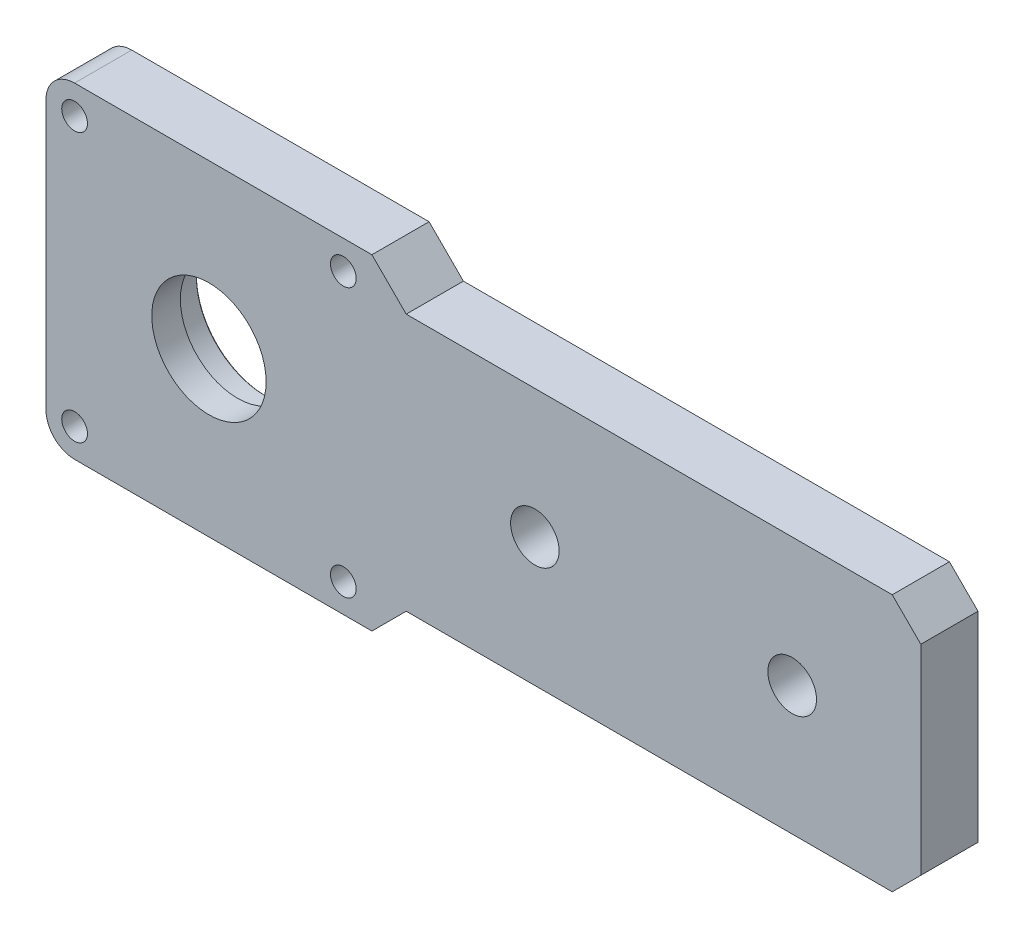
ISO-10303-21;
HEADER;
FILE_DESCRIPTION(('STEP AP214'),'2;1');
FILE_NAME('part.step','',(''),(''),'','','');
FILE_SCHEMA(('AUTOMOTIVE_DESIGN { 1 0 10303 214 1 1 1 1 }'));
ENDSEC;
DATA;
#1=APPLICATION_CONTEXT('core data for automotive mechanical design processes');
#2=APPLICATION_PROTOCOL_DEFINITION('international standard','automotive_design',2000,#1);
#3=PRODUCT_CONTEXT('',#1,'mechanical');
#4=PRODUCT('Part','Part','',(#3));
#5=PRODUCT_RELATED_PRODUCT_CATEGORY('part','',(#4));
#6=PRODUCT_DEFINITION_FORMATION('','',#4);
#7=PRODUCT_DEFINITION_CONTEXT('part definition',#1,'design');
#8=PRODUCT_DEFINITION('design','',#6,#7);
#9=PRODUCT_DEFINITION_SHAPE('','',#8);
#10=(LENGTH_UNIT() NAMED_UNIT(*) SI_UNIT(.MILLI.,.METRE.));
#11=(NAMED_UNIT(*) PLANE_ANGLE_UNIT() SI_UNIT($,.RADIAN.));
#12=(NAMED_UNIT(*) SI_UNIT($,.STERADIAN.) SOLID_ANGLE_UNIT());
#13=UNCERTAINTY_MEASURE_WITH_UNIT(LENGTH_MEASURE(1.E-05),#10,'distance_accuracy_value','');
#14=(GEOMETRIC_REPRESENTATION_CONTEXT(3) GLOBAL_UNCERTAINTY_ASSIGNED_CONTEXT((#13)) GLOBAL_UNIT_ASSIGNED_CONTEXT((#10,
#11,#12)) REPRESENTATION_CONTEXT('',''));
#15=CARTESIAN_POINT('',(0.,0.,0.));
#16=DIRECTION('',(0.,0.,1.));
#17=DIRECTION('',(1.,0.,0.));
#18=AXIS2_PLACEMENT_3D('',#15,#16,#17);
#19=CARTESIAN_POINT('',(0.,0.,-5.));
#20=DIRECTION('',(0.,0.,1.));
#21=DIRECTION('',(1.,0.,0.));
#22=AXIS2_PLACEMENT_3D('',#19,#20,#21);
#23=CYLINDRICAL_SURFACE('',#22,10.);
#24=CARTESIAN_POINT('',(0.,0.,5.));
#25=DIRECTION('',(0.,0.,1.));
#26=DIRECTION('',(1.,0.,0.));
#27=AXIS2_PLACEMENT_3D('',#24,#25,#26);
#28=CIRCLE('',#27,10.);
#29=CARTESIAN_POINT('',(10.,0.,5.));
#30=VERTEX_POINT('',#29);
#31=EDGE_CURVE('E179',#30,#30,#28,.T.);
#32=ORIENTED_EDGE('',*,*,#31,.T.);
#33=EDGE_LOOP('',(#32));
#34=FACE_BOUND('',#33,.T.);
#35=CARTESIAN_POINT('',(0.,0.,0.));
#36=DIRECTION('',(0.,0.,-1.));
#37=DIRECTION('',(-1.,0.,0.));
#38=AXIS2_PLACEMENT_3D('',#35,#36,#37);
#39=CIRCLE('',#38,10.);
#40=CARTESIAN_POINT('',(-10.,0.,0.));
#41=VERTEX_POINT('',#40);
#42=EDGE_CURVE('E177',#41,#41,#39,.F.);
#43=ORIENTED_EDGE('',*,*,#42,.F.);
#44=EDGE_LOOP('',(#43));
#45=FACE_BOUND('',#44,.T.);
#46=ADVANCED_FACE('F50',(#34,#45),#23,.F.);
#47=CARTESIAN_POINT('',(0.,-28.5,4.99999999999999));
#48=DIRECTION('',(0.,1.,0.));
#49=DIRECTION('',(0.,0.,1.));
#50=AXIS2_PLACEMENT_3D('',#47,#48,#49);
#51=PLANE('',#50);
#52=DIRECTION('',(1.,0.,0.));
#53=VECTOR('',#52,1.);
#54=CARTESIAN_POINT('',(0.,-28.5,4.99999999999999));
#55=LINE('',#54,#53);
#56=CARTESIAN_POINT('',(-23.5000000000001,-28.5,4.99999999999999));
#57=VERTEX_POINT('',#56);
#58=CARTESIAN_POINT('',(28.5,-28.5,4.99999999999991));
#59=VERTEX_POINT('',#58);
#60=EDGE_CURVE('E142',#57,#59,#55,.T.);
#61=ORIENTED_EDGE('',*,*,#60,.F.);
#62=DIRECTION('',(0.,0.,-1.));
#63=VECTOR('',#62,1.);
#64=CARTESIAN_POINT('',(-23.5000000000001,-28.5,-5.));
#65=LINE('',#64,#63);
#66=CARTESIAN_POINT('',(-23.5000000000001,-28.5,-5.));
#67=VERTEX_POINT('',#66);
#68=EDGE_CURVE('E193',#57,#67,#65,.T.);
#69=ORIENTED_EDGE('',*,*,#68,.T.);
#70=DIRECTION('',(1.,0.,0.));
#71=VECTOR('',#70,1.);
#72=CARTESIAN_POINT('',(0.,-28.5,-5.));
#73=LINE('',#72,#71);
#74=CARTESIAN_POINT('',(28.5,-28.5,-5.00000000000009));
#75=VERTEX_POINT('',#74);
#76=EDGE_CURVE('E167',#67,#75,#73,.T.);
#77=ORIENTED_EDGE('',*,*,#76,.T.);
#78=DIRECTION('',(0.,0.,-1.));
#79=VECTOR('',#78,1.);
#80=CARTESIAN_POINT('',(28.5,-28.5,4.99999999999991));
#81=LINE('',#80,#79);
#82=EDGE_CURVE('E160',#59,#75,#81,.T.);
#83=ORIENTED_EDGE('',*,*,#82,.F.);
#84=EDGE_LOOP('',(#61,#69,#77,#83));
#85=FACE_BOUND('',#84,.T.);
#86=ADVANCED_FACE('F165',(#85),#51,.F.);
#87=CARTESIAN_POINT('',(28.4999999999999,-28.5000000000002,4.99999999999991));
#88=DIRECTION('',(-0.707106781186545,0.707106781186552,0.));
#89=DIRECTION('',(-0.707106781186551,-0.707106781186543,0.));
#90=AXIS2_PLACEMENT_3D('',#87,#88,#89);
#91=PLANE('',#90);
#92=DIRECTION('',(0.707106781186551,0.707106781186543,0.));
#93=VECTOR('',#92,1.);
#94=CARTESIAN_POINT('',(28.4999999999999,-28.5000000000002,-5.00000000000009));
#95=LINE('',#94,#93);
#96=CARTESIAN_POINT('',(34.5,-22.5,-5.00000000000009));
#97=VERTEX_POINT('',#96);
#98=EDGE_CURVE('E310',#75,#97,#95,.T.);
#99=ORIENTED_EDGE('',*,*,#98,.T.);
#100=DIRECTION('',(0.,0.,-1.));
#101=VECTOR('',#100,1.);
#102=CARTESIAN_POINT('',(34.5,-22.5,4.99999999999992));
#103=LINE('',#102,#101);
#104=CARTESIAN_POINT('',(34.5,-22.5,4.99999999999992));
#105=VERTEX_POINT('',#104);
#106=EDGE_CURVE('E162',#105,#97,#103,.T.);
#107=ORIENTED_EDGE('',*,*,#106,.F.);
#108=DIRECTION('',(0.707106781186551,0.707106781186543,0.));
#109=VECTOR('',#108,1.);
#110=CARTESIAN_POINT('',(28.4999999999999,-28.5000000000002,4.99999999999991));
#111=LINE('',#110,#109);
#112=EDGE_CURVE('E145',#59,#105,#111,.T.);
#113=ORIENTED_EDGE('',*,*,#112,.F.);
#114=ORIENTED_EDGE('',*,*,#82,.T.);
#115=EDGE_LOOP('',(#99,#107,#113,#114));
#116=FACE_BOUND('',#115,.T.);
#117=ADVANCED_FACE('F159',(#116),#91,.F.);
#118=CARTESIAN_POINT('',(0.,-22.5,5.));
#119=DIRECTION('',(0.,-1.,0.));
#120=DIRECTION('',(1.,0.,0.));
#121=AXIS2_PLACEMENT_3D('',#118,#119,#120);
#122=PLANE('',#121);
#123=DIRECTION('',(-1.,0.,0.));
#124=VECTOR('',#123,1.);
#125=CARTESIAN_POINT('',(0.,-22.5,-5.));
#126=LINE('',#125,#124);
#127=CARTESIAN_POINT('',(119.5,-22.5000000000001,-5.00000000000016));
#128=VERTEX_POINT('',#127);
#129=EDGE_CURVE('E312',#128,#97,#126,.T.);
#130=ORIENTED_EDGE('',*,*,#129,.F.);
#131=DIRECTION('',(0.,0.,1.));
#132=VECTOR('',#131,1.);
#133=CARTESIAN_POINT('',(119.5,-22.5000000000001,4.99999999999984));
#134=LINE('',#133,#132);
#135=CARTESIAN_POINT('',(119.5,-22.5000000000001,4.99999999999984));
#136=VERTEX_POINT('',#135);
#137=EDGE_CURVE('E65',#128,#136,#134,.T.);
#138=ORIENTED_EDGE('',*,*,#137,.T.);
#139=DIRECTION('',(-1.,0.,0.));
#140=VECTOR('',#139,1.);
#141=CARTESIAN_POINT('',(0.,-22.5,5.));
#142=LINE('',#141,#140);
#143=EDGE_CURVE('E163',#136,#105,#142,.T.);
#144=ORIENTED_EDGE('',*,*,#143,.T.);
#145=ORIENTED_EDGE('',*,*,#106,.T.);
#146=EDGE_LOOP('',(#130,#138,#144,#145));
#147=FACE_BOUND('',#146,.T.);
#148=ADVANCED_FACE('F269',(#147),#122,.T.);
#149=CARTESIAN_POINT('',(124.5,0.,4.99999999999984));
#150=DIRECTION('',(-1.,0.,0.));
#151=DIRECTION('',(0.,0.,1.));
#152=AXIS2_PLACEMENT_3D('',#149,#150,#151);
#153=PLANE('',#152);
#154=DIRECTION('',(0.,1.,0.));
#155=VECTOR('',#154,1.);
#156=CARTESIAN_POINT('',(124.5,0.,-5.00000000000016));
#157=LINE('',#156,#155);
#158=CARTESIAN_POINT('',(124.5,-17.5000000000001,-5.00000000000017));
#159=VERTEX_POINT('',#158);
#160=CARTESIAN_POINT('',(124.5,17.4999999999999,-5.00000000000009));
#161=VERTEX_POINT('',#160);
#162=EDGE_CURVE('E314',#159,#161,#157,.T.);
#163=ORIENTED_EDGE('',*,*,#162,.T.);
#164=DIRECTION('',(0.,0.,1.));
#165=VECTOR('',#164,1.);
#166=CARTESIAN_POINT('',(124.5,17.4999999999999,4.99999999999991));
#167=LINE('',#166,#165);
#168=CARTESIAN_POINT('',(124.5,17.4999999999999,4.99999999999991));
#169=VERTEX_POINT('',#168);
#170=EDGE_CURVE('E73',#161,#169,#167,.T.);
#171=ORIENTED_EDGE('',*,*,#170,.T.);
#172=DIRECTION('',(0.,1.,0.));
#173=VECTOR('',#172,1.);
#174=CARTESIAN_POINT('',(124.5,0.,4.99999999999984));
#175=LINE('',#174,#173);
#176=CARTESIAN_POINT('',(124.5,-17.5000000000001,4.99999999999984));
#177=VERTEX_POINT('',#176);
#178=EDGE_CURVE('E293',#177,#169,#175,.T.);
#179=ORIENTED_EDGE('',*,*,#178,.F.);
#180=DIRECTION('',(0.,0.,-1.));
#181=VECTOR('',#180,1.);
#182=CARTESIAN_POINT('',(124.5,-17.5000000000001,-5.00000000000017));
#183=LINE('',#182,#181);
#184=EDGE_CURVE('E202',#177,#159,#183,.T.);
#185=ORIENTED_EDGE('',*,*,#184,.T.);
#186=EDGE_LOOP('',(#163,#171,#179,#185));
#187=FACE_BOUND('',#186,.T.);
#188=ADVANCED_FACE('F265',(#187),#153,.F.);
#189=CARTESIAN_POINT('',(0.,22.5,5.));
#190=DIRECTION('',(0.,-1.,0.));
#191=DIRECTION('',(1.,0.,0.));
#192=AXIS2_PLACEMENT_3D('',#189,#190,#191);
#193=PLANE('',#192);
#194=DIRECTION('',(-1.,0.,0.));
#195=VECTOR('',#194,1.);
#196=CARTESIAN_POINT('',(0.,22.5,5.));
#197=LINE('',#196,#195);
#198=CARTESIAN_POINT('',(119.5,22.5,4.99999999999984));
#199=VERTEX_POINT('',#198);
#200=CARTESIAN_POINT('',(34.5000000000001,22.5,4.99999999999992));
#201=VERTEX_POINT('',#200);
#202=EDGE_CURVE('E291',#199,#201,#197,.T.);
#203=ORIENTED_EDGE('',*,*,#202,.F.);
#204=DIRECTION('',(0.,0.,-1.));
#205=VECTOR('',#204,1.);
#206=CARTESIAN_POINT('',(119.5,22.5,4.99999999999984));
#207=LINE('',#206,#205);
#208=CARTESIAN_POINT('',(119.5,22.5,-5.00000000000016));
#209=VERTEX_POINT('',#208);
#210=EDGE_CURVE('E195',#199,#209,#207,.T.);
#211=ORIENTED_EDGE('',*,*,#210,.T.);
#212=DIRECTION('',(-1.,0.,0.));
#213=VECTOR('',#212,1.);
#214=CARTESIAN_POINT('',(0.,22.5,-5.));
#215=LINE('',#214,#213);
#216=CARTESIAN_POINT('',(34.5000000000001,22.5,-5.00000000000009));
#217=VERTEX_POINT('',#216);
#218=EDGE_CURVE('E316',#209,#217,#215,.T.);
#219=ORIENTED_EDGE('',*,*,#218,.T.);
#220=DIRECTION('',(0.,0.,-1.));
#221=VECTOR('',#220,1.);
#222=CARTESIAN_POINT('',(34.5000000000001,22.5,4.99999999999992));
#223=LINE('',#222,#221);
#224=EDGE_CURVE('E173',#201,#217,#223,.T.);
#225=ORIENTED_EDGE('',*,*,#224,.F.);
#226=EDGE_LOOP('',(#203,#211,#219,#225));
#227=FACE_BOUND('',#226,.T.);
#228=ADVANCED_FACE('F261',(#227),#193,.F.);
#229=CARTESIAN_POINT('',(28.4999999999999,28.5000000000001,4.99999999999992));
#230=DIRECTION('',(0.707106781186543,0.707106781186551,0.));
#231=DIRECTION('',(-0.707106781186552,0.707106781186545,0.));
#232=AXIS2_PLACEMENT_3D('',#229,#230,#231);
#233=PLANE('',#232);
#234=DIRECTION('',(0.707106781186552,-0.707106781186545,0.));
#235=VECTOR('',#234,1.);
#236=CARTESIAN_POINT('',(28.4999999999999,28.5000000000001,-5.00000000000007));
#237=LINE('',#236,#235);
#238=CARTESIAN_POINT('',(28.5,28.5,-5.00000000000007));
#239=VERTEX_POINT('',#238);
#240=EDGE_CURVE('E318',#239,#217,#237,.T.);
#241=ORIENTED_EDGE('',*,*,#240,.F.);
#242=DIRECTION('',(0.,0.,-1.));
#243=VECTOR('',#242,1.);
#244=CARTESIAN_POINT('',(28.5,28.5,4.99999999999992));
#245=LINE('',#244,#243);
#246=CARTESIAN_POINT('',(28.5,28.5,4.99999999999992));
#247=VERTEX_POINT('',#246);
#248=EDGE_CURVE('E308',#247,#239,#245,.T.);
#249=ORIENTED_EDGE('',*,*,#248,.F.);
#250=DIRECTION('',(0.707106781186552,-0.707106781186545,0.));
#251=VECTOR('',#250,1.);
#252=CARTESIAN_POINT('',(28.4999999999999,28.5000000000001,4.99999999999992));
#253=LINE('',#252,#251);
#254=EDGE_CURVE('E297',#247,#201,#253,.T.);
#255=ORIENTED_EDGE('',*,*,#254,.T.);
#256=ORIENTED_EDGE('',*,*,#224,.T.);
#257=EDGE_LOOP('',(#241,#249,#255,#256));
#258=FACE_BOUND('',#257,.T.);
#259=ADVANCED_FACE('F257',(#258),#233,.T.);
#260=CARTESIAN_POINT('',(0.,28.5,5.));
#261=DIRECTION('',(0.,1.,0.));
#262=DIRECTION('',(-1.,0.,0.));
#263=AXIS2_PLACEMENT_3D('',#260,#261,#262);
#264=PLANE('',#263);
#265=DIRECTION('',(1.,0.,0.));
#266=VECTOR('',#265,1.);
#267=CARTESIAN_POINT('',(0.,28.5,-4.99999999999999));
#268=LINE('',#267,#266);
#269=CARTESIAN_POINT('',(-23.5000000000001,28.5,-4.99999999999999));
#270=VERTEX_POINT('',#269);
#271=EDGE_CURVE('E321',#270,#239,#268,.T.);
#272=ORIENTED_EDGE('',*,*,#271,.F.);
#273=DIRECTION('',(0.,0.,-1.));
#274=VECTOR('',#273,1.);
#275=CARTESIAN_POINT('',(-23.5000000000001,28.5,5.));
#276=LINE('',#275,#274);
#277=CARTESIAN_POINT('',(-23.5000000000001,28.5,5.));
#278=VERTEX_POINT('',#277);
#279=EDGE_CURVE('E188',#270,#278,#276,.F.);
#280=ORIENTED_EDGE('',*,*,#279,.T.);
#281=DIRECTION('',(1.,0.,0.));
#282=VECTOR('',#281,1.);
#283=CARTESIAN_POINT('',(0.,28.5,5.));
#284=LINE('',#283,#282);
#285=EDGE_CURVE('E299',#278,#247,#284,.T.);
#286=ORIENTED_EDGE('',*,*,#285,.T.);
#287=ORIENTED_EDGE('',*,*,#248,.T.);
#288=EDGE_LOOP('',(#272,#280,#286,#287));
#289=FACE_BOUND('',#288,.T.);
#290=ADVANCED_FACE('F253',(#289),#264,.T.);
#291=CARTESIAN_POINT('',(-28.5,0.,5.));
#292=DIRECTION('',(-1.,0.,0.));
#293=DIRECTION('',(0.,-1.,0.));
#294=AXIS2_PLACEMENT_3D('',#291,#292,#293);
#295=PLANE('',#294);
#296=CARTESIAN_POINT('',(-28.5,12.5,0.));
#297=DIRECTION('',(-1.,0.,0.));
#298=DIRECTION('',(0.,0.,1.));
#299=AXIS2_PLACEMENT_3D('',#296,#297,#298);
#300=CIRCLE('',#299,2.025);
#301=CARTESIAN_POINT('',(-28.5,12.5,2.025));
#302=VERTEX_POINT('',#301);
#303=EDGE_CURVE('E418',#302,#302,#300,.T.);
#304=ORIENTED_EDGE('',*,*,#303,.F.);
#305=EDGE_LOOP('',(#304));
#306=FACE_BOUND('',#305,.T.);
#307=CARTESIAN_POINT('',(-28.5,-12.5,0.));
#308=DIRECTION('',(-1.,0.,0.));
#309=DIRECTION('',(0.,0.,1.));
#310=AXIS2_PLACEMENT_3D('',#307,#308,#309);
#311=CIRCLE('',#310,2.025);
#312=CARTESIAN_POINT('',(-28.5,-12.5,2.025));
#313=VERTEX_POINT('',#312);
#314=EDGE_CURVE('E409',#313,#313,#311,.T.);
#315=ORIENTED_EDGE('',*,*,#314,.F.);
#316=EDGE_LOOP('',(#315));
#317=FACE_BOUND('',#316,.T.);
#318=DIRECTION('',(0.,1.,0.));
#319=VECTOR('',#318,1.);
#320=CARTESIAN_POINT('',(-28.5,0.,5.));
#321=LINE('',#320,#319);
#322=CARTESIAN_POINT('',(-28.5,-23.5,5.));
#323=VERTEX_POINT('',#322);
#324=CARTESIAN_POINT('',(-28.5,23.5,4.99999999999999));
#325=VERTEX_POINT('',#324);
#326=EDGE_CURVE('E305',#323,#325,#321,.T.);
#327=ORIENTED_EDGE('',*,*,#326,.T.);
#328=DIRECTION('',(0.,0.,-1.));
#329=VECTOR('',#328,1.);
#330=CARTESIAN_POINT('',(-28.5,23.5,4.99999999999999));
#331=LINE('',#330,#329);
#332=CARTESIAN_POINT('',(-28.5,23.5,-5.));
#333=VERTEX_POINT('',#332);
#334=EDGE_CURVE('E171',#325,#333,#331,.T.);
#335=ORIENTED_EDGE('',*,*,#334,.T.);
#336=DIRECTION('',(0.,1.,0.));
#337=VECTOR('',#336,1.);
#338=CARTESIAN_POINT('',(-28.5,0.,-5.));
#339=LINE('',#338,#337);
#340=CARTESIAN_POINT('',(-28.5,-23.5,-5.));
#341=VERTEX_POINT('',#340);
#342=EDGE_CURVE('E154',#341,#333,#339,.T.);
#343=ORIENTED_EDGE('',*,*,#342,.F.);
#344=DIRECTION('',(0.,0.,-1.));
#345=VECTOR('',#344,1.);
#346=CARTESIAN_POINT('',(-28.5,-23.5,5.));
#347=LINE('',#346,#345);
#348=EDGE_CURVE('E169',#341,#323,#347,.F.);
#349=ORIENTED_EDGE('',*,*,#348,.T.);
#350=EDGE_LOOP('',(#327,#335,#343,#349));
#351=FACE_BOUND('',#350,.T.);
#352=ADVANCED_FACE('F245',(#306,#317,#351),#295,.T.);
#353=CARTESIAN_POINT('',(0.,0.,5.));
#354=DIRECTION('',(0.,0.,1.));
#355=DIRECTION('',(1.,0.,0.));
#356=AXIS2_PLACEMENT_3D('',#353,#354,#355);
#357=PLANE('',#356);
#358=CARTESIAN_POINT('',(23.5,23.5,4.99999999999992));
#359=DIRECTION('',(0.,0.,-1.));
#360=DIRECTION('',(-1.,0.,0.));
#361=AXIS2_PLACEMENT_3D('',#358,#359,#360);
#362=CIRCLE('',#361,2.25);
#363=CARTESIAN_POINT('',(21.25,23.5,4.99999999999992));
#364=VERTEX_POINT('',#363);
#365=EDGE_CURVE('E391',#364,#364,#362,.T.);
#366=ORIENTED_EDGE('',*,*,#365,.T.);
#367=EDGE_LOOP('',(#366));
#368=FACE_BOUND('',#367,.T.);
#369=CARTESIAN_POINT('',(-23.5000000000001,23.5,5.));
#370=DIRECTION('',(0.,0.,-1.));
#371=DIRECTION('',(-1.,0.,0.));
#372=AXIS2_PLACEMENT_3D('',#369,#370,#371);
#373=CIRCLE('',#372,2.25);
#374=CARTESIAN_POINT('',(-25.7500000000001,23.5,5.00000000000001));
#375=VERTEX_POINT('',#374);
#376=EDGE_CURVE('E379',#375,#375,#373,.T.);
#377=ORIENTED_EDGE('',*,*,#376,.T.);
#378=EDGE_LOOP('',(#377));
#379=FACE_BOUND('',#378,.T.);
#380=CARTESIAN_POINT('',(-23.5000000000001,-23.5,5.));
#381=DIRECTION('',(0.,0.,-1.));
#382=DIRECTION('',(-1.,0.,0.));
#383=AXIS2_PLACEMENT_3D('',#380,#381,#382);
#384=CIRCLE('',#383,2.25);
#385=CARTESIAN_POINT('',(-25.7500000000001,-23.5,5.00000000000001));
#386=VERTEX_POINT('',#385);
#387=EDGE_CURVE('E367',#386,#386,#384,.T.);
#388=ORIENTED_EDGE('',*,*,#387,.T.);
#389=EDGE_LOOP('',(#388));
#390=FACE_BOUND('',#389,.T.);
#391=CARTESIAN_POINT('',(23.5,-23.5,4.99999999999992));
#392=DIRECTION('',(0.,0.,-1.));
#393=DIRECTION('',(-1.,0.,0.));
#394=AXIS2_PLACEMENT_3D('',#391,#392,#393);
#395=CIRCLE('',#394,2.25);
#396=CARTESIAN_POINT('',(21.25,-23.5,4.99999999999992));
#397=VERTEX_POINT('',#396);
#398=EDGE_CURVE('E355',#397,#397,#395,.T.);
#399=ORIENTED_EDGE('',*,*,#398,.T.);
#400=EDGE_LOOP('',(#399));
#401=FACE_BOUND('',#400,.T.);
#402=CARTESIAN_POINT('',(57.,0.,4.99999999999992));
#403=DIRECTION('',(0.,0.,1.));
#404=DIRECTION('',(1.,0.,0.));
#405=AXIS2_PLACEMENT_3D('',#402,#403,#404);
#406=CIRCLE('',#405,4.25);
#407=CARTESIAN_POINT('',(61.25,0.,4.99999999999992));
#408=VERTEX_POINT('',#407);
#409=EDGE_CURVE('E352',#408,#408,#406,.T.);
#410=ORIENTED_EDGE('',*,*,#409,.F.);
#411=EDGE_LOOP('',(#410));
#412=FACE_BOUND('',#411,.T.);
#413=CARTESIAN_POINT('',(102.,0.,4.99999999999992));
#414=DIRECTION('',(0.,0.,1.));
#415=DIRECTION('',(1.,0.,0.));
#416=AXIS2_PLACEMENT_3D('',#413,#414,#415);
#417=CIRCLE('',#416,4.25);
#418=CARTESIAN_POINT('',(106.25,0.,4.99999999999992));
#419=VERTEX_POINT('',#418);
#420=EDGE_CURVE('E346',#419,#419,#417,.T.);
#421=ORIENTED_EDGE('',*,*,#420,.F.);
#422=EDGE_LOOP('',(#421));
#423=FACE_BOUND('',#422,.T.);
#424=ORIENTED_EDGE('',*,*,#31,.F.);
#425=EDGE_LOOP('',(#424));
#426=FACE_BOUND('',#425,.T.);
#427=ORIENTED_EDGE('',*,*,#178,.T.);
#428=DIRECTION('',(0.707106781186547,-0.707106781186549,0.));
#429=VECTOR('',#428,1.);
#430=CARTESIAN_POINT('',(71.0000000000002,71.,4.99999999999991));
#431=LINE('',#430,#429);
#432=EDGE_CURVE('E208',#169,#199,#431,.F.);
#433=ORIENTED_EDGE('',*,*,#432,.T.);
#434=ORIENTED_EDGE('',*,*,#202,.T.);
#435=ORIENTED_EDGE('',*,*,#254,.F.);
#436=ORIENTED_EDGE('',*,*,#285,.F.);
#437=CARTESIAN_POINT('',(-23.5000000000001,23.5,4.99999999999999));
#438=DIRECTION('',(0.,0.,1.));
#439=DIRECTION('',(1.,0.,0.));
#440=AXIS2_PLACEMENT_3D('',#437,#438,#439);
#441=CIRCLE('',#440,5.);
#442=EDGE_CURVE('E191',#278,#325,#441,.T.);
#443=ORIENTED_EDGE('',*,*,#442,.T.);
#444=ORIENTED_EDGE('',*,*,#326,.F.);
#445=CARTESIAN_POINT('',(-23.5000000000001,-23.5,5.));
#446=DIRECTION('',(0.,0.,1.));
#447=DIRECTION('',(1.,0.,0.));
#448=AXIS2_PLACEMENT_3D('',#445,#446,#447);
#449=CIRCLE('',#448,5.);
#450=EDGE_CURVE('E149',#323,#57,#449,.T.);
#451=ORIENTED_EDGE('',*,*,#450,.T.);
#452=ORIENTED_EDGE('',*,*,#60,.T.);
#453=ORIENTED_EDGE('',*,*,#112,.T.);
#454=ORIENTED_EDGE('',*,*,#143,.F.);
#455=DIRECTION('',(0.707106781186549,0.707106781186545,0.));
#456=VECTOR('',#455,1.);
#457=CARTESIAN_POINT('',(70.9999999999996,-71.0000000000001,4.99999999999999));
#458=LINE('',#457,#456);
#459=EDGE_CURVE('E206',#136,#177,#458,.T.);
#460=ORIENTED_EDGE('',*,*,#459,.T.);
#461=EDGE_LOOP('',(#427,#433,#434,#435,#436,#443,#444,#451,#452,#453,#454,#460));
#462=FACE_BOUND('',#461,.T.);
#463=ADVANCED_FACE('F144',(#368,#379,#390,#401,#412,#423,#426,#462),#357,.T.);
#464=CARTESIAN_POINT('',(0.,0.,-5.));
#465=DIRECTION('',(0.,0.,1.));
#466=DIRECTION('',(1.,0.,0.));
#467=AXIS2_PLACEMENT_3D('',#464,#465,#466);
#468=PLANE('',#467);
#469=CARTESIAN_POINT('',(0.,0.,-5.));
#470=DIRECTION('',(0.,0.,1.));
#471=DIRECTION('',(1.,0.,0.));
#472=AXIS2_PLACEMENT_3D('',#469,#470,#471);
#473=CIRCLE('',#472,12.2);
#474=CARTESIAN_POINT('',(12.2,0.,-5.00000000000001));
#475=VERTEX_POINT('',#474);
#476=EDGE_CURVE('E12',#475,#475,#473,.T.);
#477=ORIENTED_EDGE('',*,*,#476,.T.);
#478=EDGE_LOOP('',(#477));
#479=FACE_BOUND('',#478,.T.);
#480=CARTESIAN_POINT('',(23.5,23.5,-5.00000000000009));
#481=DIRECTION('',(0.,0.,-1.));
#482=DIRECTION('',(-1.,0.,0.));
#483=AXIS2_PLACEMENT_3D('',#480,#481,#482);
#484=CIRCLE('',#483,4.);
#485=CARTESIAN_POINT('',(19.5,23.5,-5.00000000000009));
#486=VERTEX_POINT('',#485);
#487=EDGE_CURVE('E400',#486,#486,#484,.T.);
#488=ORIENTED_EDGE('',*,*,#487,.F.);
#489=EDGE_LOOP('',(#488));
#490=FACE_BOUND('',#489,.T.);
#491=CARTESIAN_POINT('',(-23.5000000000001,23.5,-5.));
#492=DIRECTION('',(0.,0.,-1.));
#493=DIRECTION('',(-1.,0.,0.));
#494=AXIS2_PLACEMENT_3D('',#491,#492,#493);
#495=CIRCLE('',#494,4.);
#496=CARTESIAN_POINT('',(-27.5000000000001,23.5,-5.));
#497=VERTEX_POINT('',#496);
#498=EDGE_CURVE('E388',#497,#497,#495,.T.);
#499=ORIENTED_EDGE('',*,*,#498,.F.);
#500=EDGE_LOOP('',(#499));
#501=FACE_BOUND('',#500,.T.);
#502=CARTESIAN_POINT('',(-23.5000000000001,-23.5,-5.));
#503=DIRECTION('',(0.,0.,-1.));
#504=DIRECTION('',(-1.,0.,0.));
#505=AXIS2_PLACEMENT_3D('',#502,#503,#504);
#506=CIRCLE('',#505,4.);
#507=CARTESIAN_POINT('',(-27.5000000000001,-23.5,-5.));
#508=VERTEX_POINT('',#507);
#509=EDGE_CURVE('E376',#508,#508,#506,.T.);
#510=ORIENTED_EDGE('',*,*,#509,.F.);
#511=EDGE_LOOP('',(#510));
#512=FACE_BOUND('',#511,.T.);
#513=CARTESIAN_POINT('',(23.5,-23.5,-5.00000000000007));
#514=DIRECTION('',(0.,0.,-1.));
#515=DIRECTION('',(-1.,0.,0.));
#516=AXIS2_PLACEMENT_3D('',#513,#514,#515);
#517=CIRCLE('',#516,4.);
#518=CARTESIAN_POINT('',(19.5,-23.5,-5.00000000000007));
#519=VERTEX_POINT('',#518);
#520=EDGE_CURVE('E364',#519,#519,#517,.T.);
#521=ORIENTED_EDGE('',*,*,#520,.F.);
#522=EDGE_LOOP('',(#521));
#523=FACE_BOUND('',#522,.T.);
#524=CARTESIAN_POINT('',(57.,0.,-5.00000000000009));
#525=DIRECTION('',(0.,0.,1.));
#526=DIRECTION('',(1.,0.,0.));
#527=AXIS2_PLACEMENT_3D('',#524,#525,#526);
#528=CIRCLE('',#527,4.25);
#529=CARTESIAN_POINT('',(61.25,0.,-5.00000000000009));
#530=VERTEX_POINT('',#529);
#531=EDGE_CURVE('E349',#530,#530,#528,.T.);
#532=ORIENTED_EDGE('',*,*,#531,.T.);
#533=EDGE_LOOP('',(#532));
#534=FACE_BOUND('',#533,.T.);
#535=CARTESIAN_POINT('',(102.,0.,-5.00000000000007));
#536=DIRECTION('',(0.,0.,1.));
#537=DIRECTION('',(1.,0.,0.));
#538=AXIS2_PLACEMENT_3D('',#535,#536,#537);
#539=CIRCLE('',#538,4.25);
#540=CARTESIAN_POINT('',(106.25,0.,-5.00000000000008));
#541=VERTEX_POINT('',#540);
#542=EDGE_CURVE('E343',#541,#541,#539,.T.);
#543=ORIENTED_EDGE('',*,*,#542,.T.);
#544=EDGE_LOOP('',(#543));
#545=FACE_BOUND('',#544,.T.);
#546=ORIENTED_EDGE('',*,*,#218,.F.);
#547=DIRECTION('',(-0.707106781186547,0.707106781186549,0.));
#548=VECTOR('',#547,1.);
#549=CARTESIAN_POINT('',(119.5,22.5,-5.00000000000016));
#550=LINE('',#549,#548);
#551=EDGE_CURVE('E200',#209,#161,#550,.F.);
#552=ORIENTED_EDGE('',*,*,#551,.T.);
#553=ORIENTED_EDGE('',*,*,#162,.F.);
#554=DIRECTION('',(-0.707106781186549,-0.707106781186545,0.));
#555=VECTOR('',#554,1.);
#556=CARTESIAN_POINT('',(124.5,-17.5000000000001,-5.00000000000017));
#557=LINE('',#556,#555);
#558=EDGE_CURVE('E198',#159,#128,#557,.T.);
#559=ORIENTED_EDGE('',*,*,#558,.T.);
#560=ORIENTED_EDGE('',*,*,#129,.T.);
#561=ORIENTED_EDGE('',*,*,#98,.F.);
#562=ORIENTED_EDGE('',*,*,#76,.F.);
#563=CARTESIAN_POINT('',(-23.5000000000001,-23.5,-5.));
#564=DIRECTION('',(0.,0.,1.));
#565=DIRECTION('',(1.,0.,0.));
#566=AXIS2_PLACEMENT_3D('',#563,#564,#565);
#567=CIRCLE('',#566,5.);
#568=EDGE_CURVE('E184',#67,#341,#567,.F.);
#569=ORIENTED_EDGE('',*,*,#568,.T.);
#570=ORIENTED_EDGE('',*,*,#342,.T.);
#571=CARTESIAN_POINT('',(-23.5000000000001,23.5,-5.));
#572=DIRECTION('',(0.,0.,1.));
#573=DIRECTION('',(1.,0.,0.));
#574=AXIS2_PLACEMENT_3D('',#571,#572,#573);
#575=CIRCLE('',#574,5.);
#576=EDGE_CURVE('E186',#333,#270,#575,.F.);
#577=ORIENTED_EDGE('',*,*,#576,.T.);
#578=ORIENTED_EDGE('',*,*,#271,.T.);
#579=ORIENTED_EDGE('',*,*,#240,.T.);
#580=EDGE_LOOP('',(#546,#552,#553,#559,#560,#561,#562,#569,#570,#577,#578,#579));
#581=FACE_BOUND('',#580,.T.);
#582=ADVANCED_FACE('F244',(#479,#490,#501,#512,#523,#534,#545,#581),#468,.F.);
#583=CARTESIAN_POINT('',(0.,0.,0.));
#584=DIRECTION('',(0.,0.,-1.));
#585=DIRECTION('',(-1.,0.,0.));
#586=AXIS2_PLACEMENT_3D('',#583,#584,#585);
#587=PLANE('',#586);
#588=CARTESIAN_POINT('',(0.,0.,0.));
#589=DIRECTION('',(0.,0.,-1.));
#590=DIRECTION('',(-1.,0.,0.));
#591=AXIS2_PLACEMENT_3D('',#588,#589,#590);
#592=CIRCLE('',#591,12.);
#593=CARTESIAN_POINT('',(-12.,0.,0.));
#594=VERTEX_POINT('',#593);
#595=EDGE_CURVE('E180',#594,#594,#592,.T.);
#596=ORIENTED_EDGE('',*,*,#595,.T.);
#597=EDGE_LOOP('',(#596));
#598=FACE_BOUND('',#597,.T.);
#599=ORIENTED_EDGE('',*,*,#42,.T.);
#600=EDGE_LOOP('',(#599));
#601=FACE_BOUND('',#600,.T.);
#602=ADVANCED_FACE('F249',(#598,#601),#587,.T.);
#603=CARTESIAN_POINT('',(0.,0.,0.));
#604=DIRECTION('',(0.,0.,-1.));
#605=DIRECTION('',(-1.,0.,0.));
#606=AXIS2_PLACEMENT_3D('',#603,#604,#605);
#607=CYLINDRICAL_SURFACE('',#606,12.);
#608=CARTESIAN_POINT('',(0.,0.,-4.8));
#609=DIRECTION('',(0.,0.,1.));
#610=DIRECTION('',(1.,0.,0.));
#611=AXIS2_PLACEMENT_3D('',#608,#609,#610);
#612=CIRCLE('',#611,12.);
#613=CARTESIAN_POINT('',(12.,0.,-4.80000000000001));
#614=VERTEX_POINT('',#613);
#615=EDGE_CURVE('E58',#614,#614,#612,.F.);
#616=ORIENTED_EDGE('',*,*,#615,.T.);
#617=EDGE_LOOP('',(#616));
#618=FACE_BOUND('',#617,.T.);
#619=ORIENTED_EDGE('',*,*,#595,.F.);
#620=EDGE_LOOP('',(#619));
#621=FACE_BOUND('',#620,.T.);
#622=ADVANCED_FACE('F213',(#618,#621),#607,.F.);
#623=CARTESIAN_POINT('',(102.,0.,4.99999999999992));
#624=DIRECTION('',(0.,0.,1.));
#625=DIRECTION('',(1.,0.,0.));
#626=AXIS2_PLACEMENT_3D('',#623,#624,#625);
#627=CYLINDRICAL_SURFACE('',#626,4.25);
#628=ORIENTED_EDGE('',*,*,#542,.F.);
#629=EDGE_LOOP('',(#628));
#630=FACE_BOUND('',#629,.T.);
#631=ORIENTED_EDGE('',*,*,#420,.T.);
#632=EDGE_LOOP('',(#631));
#633=FACE_BOUND('',#632,.T.);
#634=ADVANCED_FACE('F493',(#630,#633),#627,.F.);
#635=CARTESIAN_POINT('',(57.,0.,4.99999999999992));
#636=DIRECTION('',(0.,0.,1.));
#637=DIRECTION('',(1.,0.,0.));
#638=AXIS2_PLACEMENT_3D('',#635,#636,#637);
#639=CYLINDRICAL_SURFACE('',#638,4.25);
#640=ORIENTED_EDGE('',*,*,#531,.F.);
#641=EDGE_LOOP('',(#640));
#642=FACE_BOUND('',#641,.T.);
#643=ORIENTED_EDGE('',*,*,#409,.T.);
#644=EDGE_LOOP('',(#643));
#645=FACE_BOUND('',#644,.T.);
#646=ADVANCED_FACE('F489',(#642,#645),#639,.F.);
#647=CARTESIAN_POINT('',(23.5,-23.5,-5.00000000000007));
#648=DIRECTION('',(0.,0.,-1.));
#649=DIRECTION('',(-1.,0.,0.));
#650=AXIS2_PLACEMENT_3D('',#647,#648,#649);
#651=CYLINDRICAL_SURFACE('',#650,2.25);
#652=ORIENTED_EDGE('',*,*,#398,.F.);
#653=EDGE_LOOP('',(#652));
#654=FACE_BOUND('',#653,.T.);
#655=CARTESIAN_POINT('',(23.5,-23.5,-0.400000000000081));
#656=DIRECTION('',(0.,0.,-1.));
#657=DIRECTION('',(-1.,0.,0.));
#658=AXIS2_PLACEMENT_3D('',#655,#656,#657);
#659=CIRCLE('',#658,2.25);
#660=CARTESIAN_POINT('',(21.25,-23.5,-0.40000000000008));
#661=VERTEX_POINT('',#660);
#662=EDGE_CURVE('E358',#661,#661,#659,.T.);
#663=ORIENTED_EDGE('',*,*,#662,.T.);
#664=EDGE_LOOP('',(#663));
#665=FACE_BOUND('',#664,.T.);
#666=ADVANCED_FACE('F485',(#654,#665),#651,.F.);
#667=CARTESIAN_POINT('',(25.7499999999999,-23.5,-0.400000000000081));
#668=DIRECTION('',(0.,0.,1.));
#669=DIRECTION('',(1.,0.,0.));
#670=AXIS2_PLACEMENT_3D('',#667,#668,#669);
#671=PLANE('',#670);
#672=ORIENTED_EDGE('',*,*,#662,.F.);
#673=EDGE_LOOP('',(#672));
#674=FACE_BOUND('',#673,.T.);
#675=CARTESIAN_POINT('',(23.5,-23.5,-0.400000000000081));
#676=DIRECTION('',(0.,0.,-1.));
#677=DIRECTION('',(-1.,0.,0.));
#678=AXIS2_PLACEMENT_3D('',#675,#676,#677);
#679=CIRCLE('',#678,4.);
#680=CARTESIAN_POINT('',(19.5,-23.5,-0.400000000000079));
#681=VERTEX_POINT('',#680);
#682=EDGE_CURVE('E361',#681,#681,#679,.T.);
#683=ORIENTED_EDGE('',*,*,#682,.T.);
#684=EDGE_LOOP('',(#683));
#685=FACE_BOUND('',#684,.T.);
#686=ADVANCED_FACE('F481',(#674,#685),#671,.F.);
#687=CARTESIAN_POINT('',(23.5,-23.5,-5.00000000000007));
#688=DIRECTION('',(0.,0.,-1.));
#689=DIRECTION('',(-1.,0.,0.));
#690=AXIS2_PLACEMENT_3D('',#687,#688,#689);
#691=CYLINDRICAL_SURFACE('',#690,4.);
#692=ORIENTED_EDGE('',*,*,#682,.F.);
#693=EDGE_LOOP('',(#692));
#694=FACE_BOUND('',#693,.T.);
#695=ORIENTED_EDGE('',*,*,#520,.T.);
#696=EDGE_LOOP('',(#695));
#697=FACE_BOUND('',#696,.T.);
#698=ADVANCED_FACE('F477',(#694,#697),#691,.F.);
#699=CARTESIAN_POINT('',(-23.5000000000001,-23.5,-5.));
#700=DIRECTION('',(0.,0.,-1.));
#701=DIRECTION('',(-1.,0.,0.));
#702=AXIS2_PLACEMENT_3D('',#699,#700,#701);
#703=CYLINDRICAL_SURFACE('',#702,2.25);
#704=ORIENTED_EDGE('',*,*,#387,.F.);
#705=EDGE_LOOP('',(#704));
#706=FACE_BOUND('',#705,.T.);
#707=CARTESIAN_POINT('',(-23.5000000000001,-23.5,-0.399999999999998));
#708=DIRECTION('',(0.,0.,-1.));
#709=DIRECTION('',(-1.,0.,0.));
#710=AXIS2_PLACEMENT_3D('',#707,#708,#709);
#711=CIRCLE('',#710,2.25);
#712=CARTESIAN_POINT('',(-25.7500000000001,-23.5,-0.399999999999996));
#713=VERTEX_POINT('',#712);
#714=EDGE_CURVE('E370',#713,#713,#711,.T.);
#715=ORIENTED_EDGE('',*,*,#714,.T.);
#716=EDGE_LOOP('',(#715));
#717=FACE_BOUND('',#716,.T.);
#718=ADVANCED_FACE('F473',(#706,#717),#703,.F.);
#719=CARTESIAN_POINT('',(-21.25,-23.5,-0.399999999999998));
#720=DIRECTION('',(0.,0.,1.));
#721=DIRECTION('',(1.,0.,0.));
#722=AXIS2_PLACEMENT_3D('',#719,#720,#721);
#723=PLANE('',#722);
#724=ORIENTED_EDGE('',*,*,#714,.F.);
#725=EDGE_LOOP('',(#724));
#726=FACE_BOUND('',#725,.T.);
#727=CARTESIAN_POINT('',(-23.5000000000001,-23.5,-0.399999999999998));
#728=DIRECTION('',(0.,0.,-1.));
#729=DIRECTION('',(-1.,0.,0.));
#730=AXIS2_PLACEMENT_3D('',#727,#728,#729);
#731=CIRCLE('',#730,4.);
#732=CARTESIAN_POINT('',(-27.5000000000001,-23.5,-0.399999999999996));
#733=VERTEX_POINT('',#732);
#734=EDGE_CURVE('E373',#733,#733,#731,.T.);
#735=ORIENTED_EDGE('',*,*,#734,.T.);
#736=EDGE_LOOP('',(#735));
#737=FACE_BOUND('',#736,.T.);
#738=ADVANCED_FACE('F469',(#726,#737),#723,.F.);
#739=CARTESIAN_POINT('',(-23.5000000000001,-23.5,-5.));
#740=DIRECTION('',(0.,0.,-1.));
#741=DIRECTION('',(-1.,0.,0.));
#742=AXIS2_PLACEMENT_3D('',#739,#740,#741);
#743=CYLINDRICAL_SURFACE('',#742,4.);
#744=ORIENTED_EDGE('',*,*,#734,.F.);
#745=EDGE_LOOP('',(#744));
#746=FACE_BOUND('',#745,.T.);
#747=ORIENTED_EDGE('',*,*,#509,.T.);
#748=EDGE_LOOP('',(#747));
#749=FACE_BOUND('',#748,.T.);
#750=ADVANCED_FACE('F465',(#746,#749),#743,.F.);
#751=CARTESIAN_POINT('',(-23.5000000000001,23.5,-5.));
#752=DIRECTION('',(0.,0.,-1.));
#753=DIRECTION('',(-1.,0.,0.));
#754=AXIS2_PLACEMENT_3D('',#751,#752,#753);
#755=CYLINDRICAL_SURFACE('',#754,2.25);
#756=ORIENTED_EDGE('',*,*,#376,.F.);
#757=EDGE_LOOP('',(#756));
#758=FACE_BOUND('',#757,.T.);
#759=CARTESIAN_POINT('',(-23.5000000000001,23.5,-0.399999999999998));
#760=DIRECTION('',(0.,0.,-1.));
#761=DIRECTION('',(-1.,0.,0.));
#762=AXIS2_PLACEMENT_3D('',#759,#760,#761);
#763=CIRCLE('',#762,2.25);
#764=CARTESIAN_POINT('',(-25.7500000000001,23.5,-0.399999999999996));
#765=VERTEX_POINT('',#764);
#766=EDGE_CURVE('E382',#765,#765,#763,.T.);
#767=ORIENTED_EDGE('',*,*,#766,.T.);
#768=EDGE_LOOP('',(#767));
#769=FACE_BOUND('',#768,.T.);
#770=ADVANCED_FACE('F461',(#758,#769),#755,.F.);
#771=CARTESIAN_POINT('',(-21.25,23.5,-0.399999999999998));
#772=DIRECTION('',(0.,0.,1.));
#773=DIRECTION('',(1.,0.,0.));
#774=AXIS2_PLACEMENT_3D('',#771,#772,#773);
#775=PLANE('',#774);
#776=ORIENTED_EDGE('',*,*,#766,.F.);
#777=EDGE_LOOP('',(#776));
#778=FACE_BOUND('',#777,.T.);
#779=CARTESIAN_POINT('',(-23.5000000000001,23.5,-0.399999999999998));
#780=DIRECTION('',(0.,0.,-1.));
#781=DIRECTION('',(-1.,0.,0.));
#782=AXIS2_PLACEMENT_3D('',#779,#780,#781);
#783=CIRCLE('',#782,4.);
#784=CARTESIAN_POINT('',(-27.5000000000001,23.5,-0.399999999999996));
#785=VERTEX_POINT('',#784);
#786=EDGE_CURVE('E385',#785,#785,#783,.T.);
#787=ORIENTED_EDGE('',*,*,#786,.T.);
#788=EDGE_LOOP('',(#787));
#789=FACE_BOUND('',#788,.T.);
#790=ADVANCED_FACE('F457',(#778,#789),#775,.F.);
#791=CARTESIAN_POINT('',(-23.5000000000001,23.5,-5.));
#792=DIRECTION('',(0.,0.,-1.));
#793=DIRECTION('',(-1.,0.,0.));
#794=AXIS2_PLACEMENT_3D('',#791,#792,#793);
#795=CYLINDRICAL_SURFACE('',#794,4.);
#796=ORIENTED_EDGE('',*,*,#786,.F.);
#797=EDGE_LOOP('',(#796));
#798=FACE_BOUND('',#797,.T.);
#799=ORIENTED_EDGE('',*,*,#498,.T.);
#800=EDGE_LOOP('',(#799));
#801=FACE_BOUND('',#800,.T.);
#802=ADVANCED_FACE('F453',(#798,#801),#795,.F.);
#803=CARTESIAN_POINT('',(23.5,23.5,-5.00000000000009));
#804=DIRECTION('',(0.,0.,-1.));
#805=DIRECTION('',(-1.,0.,0.));
#806=AXIS2_PLACEMENT_3D('',#803,#804,#805);
#807=CYLINDRICAL_SURFACE('',#806,2.25);
#808=ORIENTED_EDGE('',*,*,#365,.F.);
#809=EDGE_LOOP('',(#808));
#810=FACE_BOUND('',#809,.T.);
#811=CARTESIAN_POINT('',(23.5,23.5,-0.400000000000081));
#812=DIRECTION('',(0.,0.,-1.));
#813=DIRECTION('',(-1.,0.,0.));
#814=AXIS2_PLACEMENT_3D('',#811,#812,#813);
#815=CIRCLE('',#814,2.25);
#816=CARTESIAN_POINT('',(21.25,23.5,-0.40000000000008));
#817=VERTEX_POINT('',#816);
#818=EDGE_CURVE('E394',#817,#817,#815,.T.);
#819=ORIENTED_EDGE('',*,*,#818,.T.);
#820=EDGE_LOOP('',(#819));
#821=FACE_BOUND('',#820,.T.);
#822=ADVANCED_FACE('F449',(#810,#821),#807,.F.);
#823=CARTESIAN_POINT('',(25.75,23.5,-0.400000000000081));
#824=DIRECTION('',(0.,0.,1.));
#825=DIRECTION('',(1.,0.,0.));
#826=AXIS2_PLACEMENT_3D('',#823,#824,#825);
#827=PLANE('',#826);
#828=ORIENTED_EDGE('',*,*,#818,.F.);
#829=EDGE_LOOP('',(#828));
#830=FACE_BOUND('',#829,.T.);
#831=CARTESIAN_POINT('',(23.5,23.5,-0.400000000000081));
#832=DIRECTION('',(0.,0.,-1.));
#833=DIRECTION('',(-1.,0.,0.));
#834=AXIS2_PLACEMENT_3D('',#831,#832,#833);
#835=CIRCLE('',#834,4.);
#836=CARTESIAN_POINT('',(19.5,23.5,-0.400000000000079));
#837=VERTEX_POINT('',#836);
#838=EDGE_CURVE('E397',#837,#837,#835,.T.);
#839=ORIENTED_EDGE('',*,*,#838,.T.);
#840=EDGE_LOOP('',(#839));
#841=FACE_BOUND('',#840,.T.);
#842=ADVANCED_FACE('F445',(#830,#841),#827,.F.);
#843=CARTESIAN_POINT('',(23.5,23.5,-5.00000000000009));
#844=DIRECTION('',(0.,0.,-1.));
#845=DIRECTION('',(-1.,0.,0.));
#846=AXIS2_PLACEMENT_3D('',#843,#844,#845);
#847=CYLINDRICAL_SURFACE('',#846,4.);
#848=ORIENTED_EDGE('',*,*,#838,.F.);
#849=EDGE_LOOP('',(#848));
#850=FACE_BOUND('',#849,.T.);
#851=ORIENTED_EDGE('',*,*,#487,.T.);
#852=EDGE_LOOP('',(#851));
#853=FACE_BOUND('',#852,.T.);
#854=ADVANCED_FACE('F278',(#850,#853),#847,.F.);
#855=CARTESIAN_POINT('',(-23.5000000000001,23.5,4.99999999999999));
#856=DIRECTION('',(0.,0.,-1.));
#857=DIRECTION('',(-1.,0.,0.));
#858=AXIS2_PLACEMENT_3D('',#855,#856,#857);
#859=CYLINDRICAL_SURFACE('',#858,5.);
#860=ORIENTED_EDGE('',*,*,#442,.F.);
#861=ORIENTED_EDGE('',*,*,#279,.F.);
#862=ORIENTED_EDGE('',*,*,#576,.F.);
#863=ORIENTED_EDGE('',*,*,#334,.F.);
#864=EDGE_LOOP('',(#860,#861,#862,#863));
#865=FACE_BOUND('',#864,.T.);
#866=ADVANCED_FACE('F274',(#865),#859,.T.);
#867=CARTESIAN_POINT('',(-23.5000000000001,-23.5,5.));
#868=DIRECTION('',(0.,0.,1.));
#869=DIRECTION('',(1.,0.,0.));
#870=AXIS2_PLACEMENT_3D('',#867,#868,#869);
#871=CYLINDRICAL_SURFACE('',#870,5.);
#872=ORIENTED_EDGE('',*,*,#450,.F.);
#873=ORIENTED_EDGE('',*,*,#348,.F.);
#874=ORIENTED_EDGE('',*,*,#568,.F.);
#875=ORIENTED_EDGE('',*,*,#68,.F.);
#876=EDGE_LOOP('',(#872,#873,#874,#875));
#877=FACE_BOUND('',#876,.T.);
#878=ADVANCED_FACE('F277',(#877),#871,.T.);
#879=CARTESIAN_POINT('',(119.5,22.5,4.99999999999984));
#880=DIRECTION('',(-0.707106781186548,-0.707106781186546,0.));
#881=DIRECTION('',(0.,0.,-1.));
#882=AXIS2_PLACEMENT_3D('',#879,#880,#881);
#883=PLANE('',#882);
#884=ORIENTED_EDGE('',*,*,#432,.F.);
#885=ORIENTED_EDGE('',*,*,#170,.F.);
#886=ORIENTED_EDGE('',*,*,#551,.F.);
#887=ORIENTED_EDGE('',*,*,#210,.F.);
#888=EDGE_LOOP('',(#884,#885,#886,#887));
#889=FACE_BOUND('',#888,.T.);
#890=ADVANCED_FACE('F227',(#889),#883,.F.);
#891=CARTESIAN_POINT('',(124.5,-17.5000000000001,4.99999999999984));
#892=DIRECTION('',(0.707106781186546,-0.70710678118655,0.));
#893=DIRECTION('',(0.,0.,1.));
#894=AXIS2_PLACEMENT_3D('',#891,#892,#893);
#895=PLANE('',#894);
#896=ORIENTED_EDGE('',*,*,#459,.F.);
#897=ORIENTED_EDGE('',*,*,#137,.F.);
#898=ORIENTED_EDGE('',*,*,#558,.F.);
#899=ORIENTED_EDGE('',*,*,#184,.F.);
#900=EDGE_LOOP('',(#896,#897,#898,#899));
#901=FACE_BOUND('',#900,.T.);
#902=ADVANCED_FACE('F218',(#901),#895,.T.);
#903=CARTESIAN_POINT('',(0.,0.,-4.8));
#904=DIRECTION('',(0.,0.,-1.));
#905=DIRECTION('',(-1.,0.,0.));
#906=AXIS2_PLACEMENT_3D('',#903,#904,#905);
#907=CONICAL_SURFACE('',#906,12.,0.785398163397422);
#908=ORIENTED_EDGE('',*,*,#476,.F.);
#909=EDGE_LOOP('',(#908));
#910=FACE_BOUND('',#909,.T.);
#911=ORIENTED_EDGE('',*,*,#615,.F.);
#912=EDGE_LOOP('',(#911));
#913=FACE_BOUND('',#912,.T.);
#914=ADVANCED_FACE('F52',(#910,#913),#907,.F.);
#915=CARTESIAN_POINT('',(-12.9999999999999,-12.5,0.));
#916=DIRECTION('',(1.,0.,0.));
#917=DIRECTION('',(0.,0.,-1.));
#918=AXIS2_PLACEMENT_3D('',#915,#916,#917);
#919=PLANE('',#918);
#920=CARTESIAN_POINT('',(-12.9999999999999,-12.5,0.));
#921=DIRECTION('',(-1.,0.,0.));
#922=DIRECTION('',(0.,0.,1.));
#923=AXIS2_PLACEMENT_3D('',#920,#921,#922);
#924=CIRCLE('',#923,1.65);
#925=CARTESIAN_POINT('',(-12.9999999999999,-12.5,1.65));
#926=VERTEX_POINT('',#925);
#927=EDGE_CURVE('E403',#926,#926,#924,.T.);
#928=ORIENTED_EDGE('',*,*,#927,.T.);
#929=EDGE_LOOP('',(#928));
#930=FACE_BOUND('',#929,.T.);
#931=ADVANCED_FACE('F217',(#930),#919,.F.);
#932=CARTESIAN_POINT('',(-28.5,-12.5,0.));
#933=DIRECTION('',(-1.,0.,0.));
#934=DIRECTION('',(0.,0.,1.));
#935=AXIS2_PLACEMENT_3D('',#932,#933,#934);
#936=CYLINDRICAL_SURFACE('',#935,1.65);
#937=ORIENTED_EDGE('',*,*,#927,.F.);
#938=EDGE_LOOP('',(#937));
#939=FACE_BOUND('',#938,.T.);
#940=CARTESIAN_POINT('',(-28.2834936490539,-12.5,0.));
#941=DIRECTION('',(-1.,0.,0.));
#942=DIRECTION('',(0.,0.,1.));
#943=AXIS2_PLACEMENT_3D('',#940,#941,#942);
#944=CIRCLE('',#943,1.65);
#945=CARTESIAN_POINT('',(-28.2834936490539,-12.5,1.65));
#946=VERTEX_POINT('',#945);
#947=EDGE_CURVE('E406',#946,#946,#944,.T.);
#948=ORIENTED_EDGE('',*,*,#947,.T.);
#949=EDGE_LOOP('',(#948));
#950=FACE_BOUND('',#949,.T.);
#951=ADVANCED_FACE('F224',(#939,#950),#936,.F.);
#952=CARTESIAN_POINT('',(-28.5,-12.5,0.));
#953=DIRECTION('',(-1.,0.,0.));
#954=DIRECTION('',(0.,0.,1.));
#955=AXIS2_PLACEMENT_3D('',#952,#953,#954);
#956=CONICAL_SURFACE('',#955,2.025,1.0471975511966);
#957=ORIENTED_EDGE('',*,*,#947,.F.);
#958=EDGE_LOOP('',(#957));
#959=FACE_BOUND('',#958,.T.);
#960=ORIENTED_EDGE('',*,*,#314,.T.);
#961=EDGE_LOOP('',(#960));
#962=FACE_BOUND('',#961,.T.);
#963=ADVANCED_FACE('F426',(#959,#962),#956,.F.);
#964=CARTESIAN_POINT('',(-12.9999999999999,12.5,0.));
#965=DIRECTION('',(1.,0.,0.));
#966=DIRECTION('',(0.,0.,-1.));
#967=AXIS2_PLACEMENT_3D('',#964,#965,#966);
#968=PLANE('',#967);
#969=CARTESIAN_POINT('',(-12.9999999999999,12.5,0.));
#970=DIRECTION('',(-1.,0.,0.));
#971=DIRECTION('',(0.,0.,1.));
#972=AXIS2_PLACEMENT_3D('',#969,#970,#971);
#973=CIRCLE('',#972,1.65);
#974=CARTESIAN_POINT('',(-12.9999999999999,12.5,1.64999999999998));
#975=VERTEX_POINT('',#974);
#976=EDGE_CURVE('E412',#975,#975,#973,.T.);
#977=ORIENTED_EDGE('',*,*,#976,.T.);
#978=EDGE_LOOP('',(#977));
#979=FACE_BOUND('',#978,.T.);
#980=ADVANCED_FACE('F428',(#979),#968,.F.);
#981=CARTESIAN_POINT('',(-28.5,12.5,0.));
#982=DIRECTION('',(-1.,0.,0.));
#983=DIRECTION('',(0.,0.,1.));
#984=AXIS2_PLACEMENT_3D('',#981,#982,#983);
#985=CYLINDRICAL_SURFACE('',#984,1.65);
#986=ORIENTED_EDGE('',*,*,#976,.F.);
#987=EDGE_LOOP('',(#986));
#988=FACE_BOUND('',#987,.T.);
#989=CARTESIAN_POINT('',(-28.2834936490539,12.5,0.));
#990=DIRECTION('',(-1.,0.,0.));
#991=DIRECTION('',(0.,0.,1.));
#992=AXIS2_PLACEMENT_3D('',#989,#990,#991);
#993=CIRCLE('',#992,1.65);
#994=CARTESIAN_POINT('',(-28.2834936490539,12.5,1.65));
#995=VERTEX_POINT('',#994);
#996=EDGE_CURVE('E415',#995,#995,#993,.T.);
#997=ORIENTED_EDGE('',*,*,#996,.T.);
#998=EDGE_LOOP('',(#997));
#999=FACE_BOUND('',#998,.T.);
#1000=ADVANCED_FACE('F435',(#988,#999),#985,.F.);
#1001=CARTESIAN_POINT('',(-28.5,12.5,0.));
#1002=DIRECTION('',(-1.,0.,0.));
#1003=DIRECTION('',(0.,0.,1.));
#1004=AXIS2_PLACEMENT_3D('',#1001,#1002,#1003);
#1005=CONICAL_SURFACE('',#1004,2.025,1.0471975511966);
#1006=ORIENTED_EDGE('',*,*,#996,.F.);
#1007=EDGE_LOOP('',(#1006));
#1008=FACE_BOUND('',#1007,.T.);
#1009=ORIENTED_EDGE('',*,*,#303,.T.);
#1010=EDGE_LOOP('',(#1009));
#1011=FACE_BOUND('',#1010,.T.);
#1012=ADVANCED_FACE('F422',(#1008,#1011),#1005,.F.);
#1013=CLOSED_SHELL('',(#46,#86,#117,#148,#188,#228,#259,#290,#352,#463,#582,#602,#622,#634,#646,
#666,#686,#698,#718,#738,#750,#770,#790,#802,#822,#842,#854,#866,#878,#890,#902,#914,#931,#951,
#963,#980,#1000,#1012));
#1014=MANIFOLD_SOLID_BREP('B2',#1013);
#1015=ADVANCED_BREP_SHAPE_REPRESENTATION('',(#18,#1014),#14);
#1016=SHAPE_DEFINITION_REPRESENTATION(#9,#1015);
ENDSEC;
END-ISO-10303-21;
